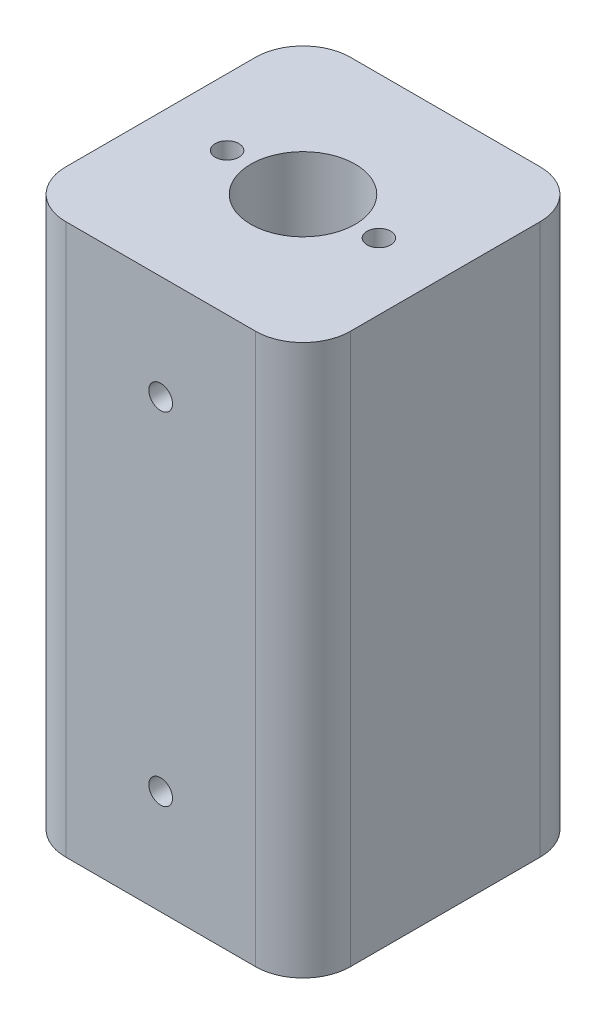
ISO-10303-21;
HEADER;
FILE_DESCRIPTION(('STEP AP214'),'2;1');
FILE_NAME('part.step','',(''),(''),'','','');
FILE_SCHEMA(('AUTOMOTIVE_DESIGN { 1 0 10303 214 1 1 1 1 }'));
ENDSEC;
DATA;
#1=APPLICATION_CONTEXT('core data for automotive mechanical design processes');
#2=APPLICATION_PROTOCOL_DEFINITION('international standard','automotive_design',2000,#1);
#3=PRODUCT_CONTEXT('',#1,'mechanical');
#4=PRODUCT('Part','Part','',(#3));
#5=PRODUCT_RELATED_PRODUCT_CATEGORY('part','',(#4));
#6=PRODUCT_DEFINITION_FORMATION('','',#4);
#7=PRODUCT_DEFINITION_CONTEXT('part definition',#1,'design');
#8=PRODUCT_DEFINITION('design','',#6,#7);
#9=PRODUCT_DEFINITION_SHAPE('','',#8);
#10=(LENGTH_UNIT() NAMED_UNIT(*) SI_UNIT(.MILLI.,.METRE.));
#11=(NAMED_UNIT(*) PLANE_ANGLE_UNIT() SI_UNIT($,.RADIAN.));
#12=(NAMED_UNIT(*) SI_UNIT($,.STERADIAN.) SOLID_ANGLE_UNIT());
#13=UNCERTAINTY_MEASURE_WITH_UNIT(LENGTH_MEASURE(1.E-05),#10,'distance_accuracy_value','');
#14=(GEOMETRIC_REPRESENTATION_CONTEXT(3) GLOBAL_UNCERTAINTY_ASSIGNED_CONTEXT((#13)) GLOBAL_UNIT_ASSIGNED_CONTEXT((#10,
#11,#12)) REPRESENTATION_CONTEXT('',''));
#15=CARTESIAN_POINT('',(0.,0.,0.));
#16=DIRECTION('',(0.,0.,1.));
#17=DIRECTION('',(1.,0.,0.));
#18=AXIS2_PLACEMENT_3D('',#15,#16,#17);
#19=CARTESIAN_POINT('',(15.,58.,-15.));
#20=DIRECTION('',(-1.,0.,0.));
#21=DIRECTION('',(0.,0.,1.));
#22=AXIS2_PLACEMENT_3D('',#19,#20,#21);
#23=PLANE('',#22);
#24=DIRECTION('',(0.,0.,-1.));
#25=VECTOR('',#24,1.);
#26=CARTESIAN_POINT('',(15.,0.,-15.));
#27=LINE('',#26,#25);
#28=CARTESIAN_POINT('',(15.,0.,10.));
#29=VERTEX_POINT('',#28);
#30=CARTESIAN_POINT('',(15.,0.,-10.));
#31=VERTEX_POINT('',#30);
#32=EDGE_CURVE('E126',#29,#31,#27,.T.);
#33=ORIENTED_EDGE('',*,*,#32,.T.);
#34=DIRECTION('',(0.,-1.,0.));
#35=VECTOR('',#34,1.);
#36=CARTESIAN_POINT('',(15.,58.,-10.));
#37=LINE('',#36,#35);
#38=CARTESIAN_POINT('',(15.,58.,-10.));
#39=VERTEX_POINT('',#38);
#40=EDGE_CURVE('E104',#31,#39,#37,.F.);
#41=ORIENTED_EDGE('',*,*,#40,.T.);
#42=DIRECTION('',(0.,0.,-1.));
#43=VECTOR('',#42,1.);
#44=CARTESIAN_POINT('',(15.,58.,-15.));
#45=LINE('',#44,#43);
#46=CARTESIAN_POINT('',(15.,58.,10.));
#47=VERTEX_POINT('',#46);
#48=EDGE_CURVE('E136',#47,#39,#45,.T.);
#49=ORIENTED_EDGE('',*,*,#48,.F.);
#50=DIRECTION('',(0.,-1.,0.));
#51=VECTOR('',#50,1.);
#52=CARTESIAN_POINT('',(15.,58.,10.));
#53=LINE('',#52,#51);
#54=EDGE_CURVE('E109',#47,#29,#53,.T.);
#55=ORIENTED_EDGE('',*,*,#54,.T.);
#56=EDGE_LOOP('',(#33,#41,#49,#55));
#57=FACE_BOUND('',#56,.T.);
#58=ADVANCED_FACE('F33',(#57),#23,.F.);
#59=CARTESIAN_POINT('',(-15.,58.,-15.));
#60=DIRECTION('',(0.,0.,1.));
#61=DIRECTION('',(1.,0.,0.));
#62=AXIS2_PLACEMENT_3D('',#59,#60,#61);
#63=PLANE('',#62);
#64=CARTESIAN_POINT('',(0.,47.,-15.));
#65=DIRECTION('',(0.,0.,1.));
#66=DIRECTION('',(1.,0.,0.));
#67=AXIS2_PLACEMENT_3D('',#64,#65,#66);
#68=CIRCLE('',#67,1.25);
#69=CARTESIAN_POINT('',(1.25,47.,-15.));
#70=VERTEX_POINT('',#69);
#71=EDGE_CURVE('E212',#70,#70,#68,.T.);
#72=ORIENTED_EDGE('',*,*,#71,.T.);
#73=EDGE_LOOP('',(#72));
#74=FACE_BOUND('',#73,.T.);
#75=CARTESIAN_POINT('',(0.,11.,-15.));
#76=DIRECTION('',(0.,0.,1.));
#77=DIRECTION('',(1.,0.,0.));
#78=AXIS2_PLACEMENT_3D('',#75,#76,#77);
#79=CIRCLE('',#78,1.25);
#80=CARTESIAN_POINT('',(1.25,11.,-15.));
#81=VERTEX_POINT('',#80);
#82=EDGE_CURVE('E206',#81,#81,#79,.T.);
#83=ORIENTED_EDGE('',*,*,#82,.T.);
#84=EDGE_LOOP('',(#83));
#85=FACE_BOUND('',#84,.T.);
#86=DIRECTION('',(-1.,0.,0.));
#87=VECTOR('',#86,1.);
#88=CARTESIAN_POINT('',(-15.,58.,-15.));
#89=LINE('',#88,#87);
#90=CARTESIAN_POINT('',(10.,58.,-15.));
#91=VERTEX_POINT('',#90);
#92=CARTESIAN_POINT('',(-10.,58.,-15.));
#93=VERTEX_POINT('',#92);
#94=EDGE_CURVE('E119',#91,#93,#89,.T.);
#95=ORIENTED_EDGE('',*,*,#94,.F.);
#96=DIRECTION('',(0.,-1.,0.));
#97=VECTOR('',#96,1.);
#98=CARTESIAN_POINT('',(10.,58.,-15.));
#99=LINE('',#98,#97);
#100=CARTESIAN_POINT('',(10.,0.,-15.));
#101=VERTEX_POINT('',#100);
#102=EDGE_CURVE('E103',#91,#101,#99,.T.);
#103=ORIENTED_EDGE('',*,*,#102,.T.);
#104=DIRECTION('',(-1.,0.,0.));
#105=VECTOR('',#104,1.);
#106=CARTESIAN_POINT('',(-15.,0.,-15.));
#107=LINE('',#106,#105);
#108=CARTESIAN_POINT('',(-10.,0.,-15.));
#109=VERTEX_POINT('',#108);
#110=EDGE_CURVE('E116',#101,#109,#107,.T.);
#111=ORIENTED_EDGE('',*,*,#110,.T.);
#112=DIRECTION('',(0.,-1.,0.));
#113=VECTOR('',#112,1.);
#114=CARTESIAN_POINT('',(-10.,58.,-15.));
#115=LINE('',#114,#113);
#116=EDGE_CURVE('E121',#109,#93,#115,.F.);
#117=ORIENTED_EDGE('',*,*,#116,.T.);
#118=EDGE_LOOP('',(#95,#103,#111,#117));
#119=FACE_BOUND('',#118,.T.);
#120=ADVANCED_FACE('F115',(#74,#85,#119),#63,.F.);
#121=CARTESIAN_POINT('',(-15.,58.,-15.));
#122=DIRECTION('',(1.,0.,0.));
#123=DIRECTION('',(0.,0.,-1.));
#124=AXIS2_PLACEMENT_3D('',#121,#122,#123);
#125=PLANE('',#124);
#126=DIRECTION('',(0.,0.,1.));
#127=VECTOR('',#126,1.);
#128=CARTESIAN_POINT('',(-15.,0.,-15.));
#129=LINE('',#128,#127);
#130=CARTESIAN_POINT('',(-15.,0.,-10.));
#131=VERTEX_POINT('',#130);
#132=CARTESIAN_POINT('',(-15.,0.,10.));
#133=VERTEX_POINT('',#132);
#134=EDGE_CURVE('E125',#131,#133,#129,.T.);
#135=ORIENTED_EDGE('',*,*,#134,.T.);
#136=DIRECTION('',(0.,-1.,0.));
#137=VECTOR('',#136,1.);
#138=CARTESIAN_POINT('',(-15.,58.,10.));
#139=LINE('',#138,#137);
#140=CARTESIAN_POINT('',(-15.,58.,10.));
#141=VERTEX_POINT('',#140);
#142=EDGE_CURVE('E11',#133,#141,#139,.F.);
#143=ORIENTED_EDGE('',*,*,#142,.T.);
#144=DIRECTION('',(0.,0.,1.));
#145=VECTOR('',#144,1.);
#146=CARTESIAN_POINT('',(-15.,58.,-15.));
#147=LINE('',#146,#145);
#148=CARTESIAN_POINT('',(-15.,58.,-10.));
#149=VERTEX_POINT('',#148);
#150=EDGE_CURVE('E162',#149,#141,#147,.T.);
#151=ORIENTED_EDGE('',*,*,#150,.F.);
#152=DIRECTION('',(0.,-1.,0.));
#153=VECTOR('',#152,1.);
#154=CARTESIAN_POINT('',(-15.,58.,-10.));
#155=LINE('',#154,#153);
#156=EDGE_CURVE('E41',#149,#131,#155,.T.);
#157=ORIENTED_EDGE('',*,*,#156,.T.);
#158=EDGE_LOOP('',(#135,#143,#151,#157));
#159=FACE_BOUND('',#158,.T.);
#160=ADVANCED_FACE('F160',(#159),#125,.F.);
#161=CARTESIAN_POINT('',(-15.,58.,15.));
#162=DIRECTION('',(0.,0.,-1.));
#163=DIRECTION('',(-1.,0.,0.));
#164=AXIS2_PLACEMENT_3D('',#161,#162,#163);
#165=PLANE('',#164);
#166=CARTESIAN_POINT('',(0.,47.,15.));
#167=DIRECTION('',(0.,0.,1.));
#168=DIRECTION('',(1.,0.,0.));
#169=AXIS2_PLACEMENT_3D('',#166,#167,#168);
#170=CIRCLE('',#169,1.25);
#171=CARTESIAN_POINT('',(1.25,47.,15.));
#172=VERTEX_POINT('',#171);
#173=EDGE_CURVE('E201',#172,#172,#170,.T.);
#174=ORIENTED_EDGE('',*,*,#173,.F.);
#175=EDGE_LOOP('',(#174));
#176=FACE_BOUND('',#175,.T.);
#177=CARTESIAN_POINT('',(0.,11.,15.));
#178=DIRECTION('',(0.,0.,1.));
#179=DIRECTION('',(1.,0.,0.));
#180=AXIS2_PLACEMENT_3D('',#177,#178,#179);
#181=CIRCLE('',#180,1.25);
#182=CARTESIAN_POINT('',(1.25,11.,15.));
#183=VERTEX_POINT('',#182);
#184=EDGE_CURVE('E194',#183,#183,#181,.T.);
#185=ORIENTED_EDGE('',*,*,#184,.F.);
#186=EDGE_LOOP('',(#185));
#187=FACE_BOUND('',#186,.T.);
#188=DIRECTION('',(1.,0.,0.));
#189=VECTOR('',#188,1.);
#190=CARTESIAN_POINT('',(-15.,0.,15.));
#191=LINE('',#190,#189);
#192=CARTESIAN_POINT('',(-10.,0.,15.));
#193=VERTEX_POINT('',#192);
#194=CARTESIAN_POINT('',(10.,0.,15.));
#195=VERTEX_POINT('',#194);
#196=EDGE_CURVE('E129',#193,#195,#191,.T.);
#197=ORIENTED_EDGE('',*,*,#196,.T.);
#198=DIRECTION('',(0.,-1.,0.));
#199=VECTOR('',#198,1.);
#200=CARTESIAN_POINT('',(10.,58.,15.));
#201=LINE('',#200,#199);
#202=CARTESIAN_POINT('',(10.,58.,15.));
#203=VERTEX_POINT('',#202);
#204=EDGE_CURVE('E48',#195,#203,#201,.F.);
#205=ORIENTED_EDGE('',*,*,#204,.T.);
#206=DIRECTION('',(1.,0.,0.));
#207=VECTOR('',#206,1.);
#208=CARTESIAN_POINT('',(-15.,58.,15.));
#209=LINE('',#208,#207);
#210=CARTESIAN_POINT('',(-10.,58.,15.));
#211=VERTEX_POINT('',#210);
#212=EDGE_CURVE('E137',#211,#203,#209,.T.);
#213=ORIENTED_EDGE('',*,*,#212,.F.);
#214=DIRECTION('',(0.,-1.,0.));
#215=VECTOR('',#214,1.);
#216=CARTESIAN_POINT('',(-10.,58.,15.));
#217=LINE('',#216,#215);
#218=EDGE_CURVE('E153',#211,#193,#217,.T.);
#219=ORIENTED_EDGE('',*,*,#218,.T.);
#220=EDGE_LOOP('',(#197,#205,#213,#219));
#221=FACE_BOUND('',#220,.T.);
#222=ADVANCED_FACE('F169',(#176,#187,#221),#165,.F.);
#223=CARTESIAN_POINT('',(0.,58.,0.));
#224=DIRECTION('',(0.,1.,0.));
#225=DIRECTION('',(0.,0.,1.));
#226=AXIS2_PLACEMENT_3D('',#223,#224,#225);
#227=PLANE('',#226);
#228=CARTESIAN_POINT('',(-8.,58.,0.));
#229=DIRECTION('',(0.,1.,0.));
#230=DIRECTION('',(0.,0.,1.));
#231=AXIS2_PLACEMENT_3D('',#228,#229,#230);
#232=CIRCLE('',#231,1.25);
#233=CARTESIAN_POINT('',(-8.,58.,1.25));
#234=VERTEX_POINT('',#233);
#235=EDGE_CURVE('E179',#234,#234,#232,.T.);
#236=ORIENTED_EDGE('',*,*,#235,.F.);
#237=EDGE_LOOP('',(#236));
#238=FACE_BOUND('',#237,.T.);
#239=CARTESIAN_POINT('',(8.,58.,0.));
#240=DIRECTION('',(0.,1.,0.));
#241=DIRECTION('',(0.,0.,1.));
#242=AXIS2_PLACEMENT_3D('',#239,#240,#241);
#243=CIRCLE('',#242,1.25);
#244=CARTESIAN_POINT('',(8.,58.,1.25));
#245=VERTEX_POINT('',#244);
#246=EDGE_CURVE('E186',#245,#245,#243,.T.);
#247=ORIENTED_EDGE('',*,*,#246,.F.);
#248=EDGE_LOOP('',(#247));
#249=FACE_BOUND('',#248,.T.);
#250=CARTESIAN_POINT('',(0.,58.,0.));
#251=DIRECTION('',(0.,1.,0.));
#252=DIRECTION('',(0.,0.,1.));
#253=AXIS2_PLACEMENT_3D('',#250,#251,#252);
#254=CIRCLE('',#253,5.5);
#255=CARTESIAN_POINT('',(0.,58.,5.5));
#256=VERTEX_POINT('',#255);
#257=EDGE_CURVE('E131',#256,#256,#254,.T.);
#258=ORIENTED_EDGE('',*,*,#257,.F.);
#259=EDGE_LOOP('',(#258));
#260=FACE_BOUND('',#259,.T.);
#261=ORIENTED_EDGE('',*,*,#48,.T.);
#262=CARTESIAN_POINT('',(10.,58.,-10.));
#263=DIRECTION('',(0.,1.,0.));
#264=DIRECTION('',(0.,0.,1.));
#265=AXIS2_PLACEMENT_3D('',#262,#263,#264);
#266=CIRCLE('',#265,5.);
#267=EDGE_CURVE('E151',#39,#91,#266,.T.);
#268=ORIENTED_EDGE('',*,*,#267,.T.);
#269=ORIENTED_EDGE('',*,*,#94,.T.);
#270=CARTESIAN_POINT('',(-10.,58.,-10.));
#271=DIRECTION('',(0.,1.,0.));
#272=DIRECTION('',(0.,0.,1.));
#273=AXIS2_PLACEMENT_3D('',#270,#271,#272);
#274=CIRCLE('',#273,5.);
#275=EDGE_CURVE('E146',#93,#149,#274,.T.);
#276=ORIENTED_EDGE('',*,*,#275,.T.);
#277=ORIENTED_EDGE('',*,*,#150,.T.);
#278=CARTESIAN_POINT('',(-10.,58.,10.));
#279=DIRECTION('',(0.,1.,0.));
#280=DIRECTION('',(0.,0.,1.));
#281=AXIS2_PLACEMENT_3D('',#278,#279,#280);
#282=CIRCLE('',#281,5.);
#283=EDGE_CURVE('E55',#141,#211,#282,.T.);
#284=ORIENTED_EDGE('',*,*,#283,.T.);
#285=ORIENTED_EDGE('',*,*,#212,.T.);
#286=CARTESIAN_POINT('',(10.,58.,10.));
#287=DIRECTION('',(0.,1.,0.));
#288=DIRECTION('',(0.,0.,1.));
#289=AXIS2_PLACEMENT_3D('',#286,#287,#288);
#290=CIRCLE('',#289,5.);
#291=EDGE_CURVE('E149',#203,#47,#290,.T.);
#292=ORIENTED_EDGE('',*,*,#291,.T.);
#293=EDGE_LOOP('',(#261,#268,#269,#276,#277,#284,#285,#292));
#294=FACE_BOUND('',#293,.T.);
#295=ADVANCED_FACE('F250',(#238,#249,#260,#294),#227,.T.);
#296=CARTESIAN_POINT('',(0.,0.,0.));
#297=DIRECTION('',(0.,1.,0.));
#298=DIRECTION('',(0.,0.,1.));
#299=AXIS2_PLACEMENT_3D('',#296,#297,#298);
#300=PLANE('',#299);
#301=CARTESIAN_POINT('',(0.,0.,0.));
#302=DIRECTION('',(0.,1.,0.));
#303=DIRECTION('',(0.,0.,1.));
#304=AXIS2_PLACEMENT_3D('',#301,#302,#303);
#305=CIRCLE('',#304,5.5);
#306=CARTESIAN_POINT('',(0.,0.,5.5));
#307=VERTEX_POINT('',#306);
#308=EDGE_CURVE('E183',#307,#307,#305,.T.);
#309=ORIENTED_EDGE('',*,*,#308,.T.);
#310=EDGE_LOOP('',(#309));
#311=FACE_BOUND('',#310,.T.);
#312=ORIENTED_EDGE('',*,*,#110,.F.);
#313=CARTESIAN_POINT('',(10.,0.,-10.));
#314=DIRECTION('',(0.,1.,0.));
#315=DIRECTION('',(0.,0.,1.));
#316=AXIS2_PLACEMENT_3D('',#313,#314,#315);
#317=CIRCLE('',#316,5.);
#318=EDGE_CURVE('E99',#101,#31,#317,.F.);
#319=ORIENTED_EDGE('',*,*,#318,.T.);
#320=ORIENTED_EDGE('',*,*,#32,.F.);
#321=CARTESIAN_POINT('',(10.,0.,10.));
#322=DIRECTION('',(0.,1.,0.));
#323=DIRECTION('',(0.,0.,1.));
#324=AXIS2_PLACEMENT_3D('',#321,#322,#323);
#325=CIRCLE('',#324,5.);
#326=EDGE_CURVE('E110',#29,#195,#325,.F.);
#327=ORIENTED_EDGE('',*,*,#326,.T.);
#328=ORIENTED_EDGE('',*,*,#196,.F.);
#329=CARTESIAN_POINT('',(-10.,0.,10.));
#330=DIRECTION('',(0.,1.,0.));
#331=DIRECTION('',(0.,0.,1.));
#332=AXIS2_PLACEMENT_3D('',#329,#330,#331);
#333=CIRCLE('',#332,5.);
#334=EDGE_CURVE('E140',#193,#133,#333,.F.);
#335=ORIENTED_EDGE('',*,*,#334,.T.);
#336=ORIENTED_EDGE('',*,*,#134,.F.);
#337=CARTESIAN_POINT('',(-10.,0.,-10.));
#338=DIRECTION('',(0.,1.,0.));
#339=DIRECTION('',(0.,0.,1.));
#340=AXIS2_PLACEMENT_3D('',#337,#338,#339);
#341=CIRCLE('',#340,5.);
#342=EDGE_CURVE('E120',#131,#109,#341,.F.);
#343=ORIENTED_EDGE('',*,*,#342,.T.);
#344=EDGE_LOOP('',(#312,#319,#320,#327,#328,#335,#336,#343));
#345=FACE_BOUND('',#344,.T.);
#346=ADVANCED_FACE('F123',(#311,#345),#300,.F.);
#347=CARTESIAN_POINT('',(0.,48.,0.));
#348=DIRECTION('',(0.,1.,0.));
#349=DIRECTION('',(0.,0.,1.));
#350=AXIS2_PLACEMENT_3D('',#347,#348,#349);
#351=CYLINDRICAL_SURFACE('',#350,5.5);
#352=ORIENTED_EDGE('',*,*,#257,.T.);
#353=EDGE_LOOP('',(#352));
#354=FACE_BOUND('',#353,.T.);
#355=ORIENTED_EDGE('',*,*,#308,.F.);
#356=EDGE_LOOP('',(#355));
#357=FACE_BOUND('',#356,.T.);
#358=ADVANCED_FACE('F260',(#354,#357),#351,.F.);
#359=CARTESIAN_POINT('',(8.,48.,0.));
#360=DIRECTION('',(0.,1.,0.));
#361=DIRECTION('',(0.,0.,1.));
#362=AXIS2_PLACEMENT_3D('',#359,#360,#361);
#363=CYLINDRICAL_SURFACE('',#362,1.25);
#364=CARTESIAN_POINT('',(8.,48.,0.));
#365=DIRECTION('',(0.,1.,0.));
#366=DIRECTION('',(0.,0.,1.));
#367=AXIS2_PLACEMENT_3D('',#364,#365,#366);
#368=CIRCLE('',#367,1.25);
#369=CARTESIAN_POINT('',(8.,48.,1.25));
#370=VERTEX_POINT('',#369);
#371=EDGE_CURVE('E178',#370,#370,#368,.T.);
#372=ORIENTED_EDGE('',*,*,#371,.F.);
#373=EDGE_LOOP('',(#372));
#374=FACE_BOUND('',#373,.T.);
#375=ORIENTED_EDGE('',*,*,#246,.T.);
#376=EDGE_LOOP('',(#375));
#377=FACE_BOUND('',#376,.T.);
#378=ADVANCED_FACE('F298',(#374,#377),#363,.F.);
#379=CARTESIAN_POINT('',(8.,48.,0.));
#380=DIRECTION('',(0.,1.,0.));
#381=DIRECTION('',(0.,0.,1.));
#382=AXIS2_PLACEMENT_3D('',#379,#380,#381);
#383=PLANE('',#382);
#384=ORIENTED_EDGE('',*,*,#371,.T.);
#385=EDGE_LOOP('',(#384));
#386=FACE_BOUND('',#385,.T.);
#387=ADVANCED_FACE('F307',(#386),#383,.T.);
#388=CARTESIAN_POINT('',(-8.,48.,0.));
#389=DIRECTION('',(0.,1.,0.));
#390=DIRECTION('',(0.,0.,1.));
#391=AXIS2_PLACEMENT_3D('',#388,#389,#390);
#392=CYLINDRICAL_SURFACE('',#391,1.25);
#393=CARTESIAN_POINT('',(-8.,48.,0.));
#394=DIRECTION('',(0.,1.,0.));
#395=DIRECTION('',(0.,0.,1.));
#396=AXIS2_PLACEMENT_3D('',#393,#394,#395);
#397=CIRCLE('',#396,1.25);
#398=CARTESIAN_POINT('',(-8.,48.,1.25));
#399=VERTEX_POINT('',#398);
#400=EDGE_CURVE('E182',#399,#399,#397,.T.);
#401=ORIENTED_EDGE('',*,*,#400,.F.);
#402=EDGE_LOOP('',(#401));
#403=FACE_BOUND('',#402,.T.);
#404=ORIENTED_EDGE('',*,*,#235,.T.);
#405=EDGE_LOOP('',(#404));
#406=FACE_BOUND('',#405,.T.);
#407=ADVANCED_FACE('F315',(#403,#406),#392,.F.);
#408=CARTESIAN_POINT('',(-8.,48.,0.));
#409=DIRECTION('',(0.,1.,0.));
#410=DIRECTION('',(0.,0.,1.));
#411=AXIS2_PLACEMENT_3D('',#408,#409,#410);
#412=PLANE('',#411);
#413=ORIENTED_EDGE('',*,*,#400,.T.);
#414=EDGE_LOOP('',(#413));
#415=FACE_BOUND('',#414,.T.);
#416=ADVANCED_FACE('F323',(#415),#412,.T.);
#417=CARTESIAN_POINT('',(0.,11.,7.));
#418=DIRECTION('',(0.,0.,1.));
#419=DIRECTION('',(1.,0.,0.));
#420=AXIS2_PLACEMENT_3D('',#417,#418,#419);
#421=CYLINDRICAL_SURFACE('',#420,1.25);
#422=CARTESIAN_POINT('',(0.,11.,7.));
#423=DIRECTION('',(0.,0.,1.));
#424=DIRECTION('',(1.,0.,0.));
#425=AXIS2_PLACEMENT_3D('',#422,#423,#424);
#426=CIRCLE('',#425,1.25);
#427=CARTESIAN_POINT('',(1.25,11.,7.));
#428=VERTEX_POINT('',#427);
#429=EDGE_CURVE('E197',#428,#428,#426,.T.);
#430=ORIENTED_EDGE('',*,*,#429,.F.);
#431=EDGE_LOOP('',(#430));
#432=FACE_BOUND('',#431,.T.);
#433=ORIENTED_EDGE('',*,*,#184,.T.);
#434=EDGE_LOOP('',(#433));
#435=FACE_BOUND('',#434,.T.);
#436=ADVANCED_FACE('F329',(#432,#435),#421,.F.);
#437=CARTESIAN_POINT('',(0.,11.,7.));
#438=DIRECTION('',(0.,0.,1.));
#439=DIRECTION('',(1.,0.,0.));
#440=AXIS2_PLACEMENT_3D('',#437,#438,#439);
#441=PLANE('',#440);
#442=ORIENTED_EDGE('',*,*,#429,.T.);
#443=EDGE_LOOP('',(#442));
#444=FACE_BOUND('',#443,.T.);
#445=ADVANCED_FACE('F336',(#444),#441,.T.);
#446=CARTESIAN_POINT('',(0.,47.,7.));
#447=DIRECTION('',(0.,0.,1.));
#448=DIRECTION('',(1.,0.,0.));
#449=AXIS2_PLACEMENT_3D('',#446,#447,#448);
#450=CYLINDRICAL_SURFACE('',#449,1.25);
#451=CARTESIAN_POINT('',(0.,47.,7.));
#452=DIRECTION('',(0.,0.,1.));
#453=DIRECTION('',(1.,0.,0.));
#454=AXIS2_PLACEMENT_3D('',#451,#452,#453);
#455=CIRCLE('',#454,1.25);
#456=CARTESIAN_POINT('',(1.25,47.,7.));
#457=VERTEX_POINT('',#456);
#458=EDGE_CURVE('E193',#457,#457,#455,.T.);
#459=ORIENTED_EDGE('',*,*,#458,.F.);
#460=EDGE_LOOP('',(#459));
#461=FACE_BOUND('',#460,.T.);
#462=ORIENTED_EDGE('',*,*,#173,.T.);
#463=EDGE_LOOP('',(#462));
#464=FACE_BOUND('',#463,.T.);
#465=ADVANCED_FACE('F344',(#461,#464),#450,.F.);
#466=CARTESIAN_POINT('',(0.,47.,7.));
#467=DIRECTION('',(0.,0.,1.));
#468=DIRECTION('',(1.,0.,0.));
#469=AXIS2_PLACEMENT_3D('',#466,#467,#468);
#470=PLANE('',#469);
#471=ORIENTED_EDGE('',*,*,#458,.T.);
#472=EDGE_LOOP('',(#471));
#473=FACE_BOUND('',#472,.T.);
#474=ADVANCED_FACE('F352',(#473),#470,.T.);
#475=CARTESIAN_POINT('',(0.,11.,-7.));
#476=DIRECTION('',(0.,0.,-1.));
#477=DIRECTION('',(-1.,0.,0.));
#478=AXIS2_PLACEMENT_3D('',#475,#476,#477);
#479=CYLINDRICAL_SURFACE('',#478,1.25);
#480=CARTESIAN_POINT('',(0.,11.,-7.));
#481=DIRECTION('',(0.,0.,1.));
#482=DIRECTION('',(1.,0.,0.));
#483=AXIS2_PLACEMENT_3D('',#480,#481,#482);
#484=CIRCLE('',#483,1.25);
#485=CARTESIAN_POINT('',(1.25,11.,-7.));
#486=VERTEX_POINT('',#485);
#487=EDGE_CURVE('E209',#486,#486,#484,.T.);
#488=ORIENTED_EDGE('',*,*,#487,.T.);
#489=EDGE_LOOP('',(#488));
#490=FACE_BOUND('',#489,.T.);
#491=ORIENTED_EDGE('',*,*,#82,.F.);
#492=EDGE_LOOP('',(#491));
#493=FACE_BOUND('',#492,.T.);
#494=ADVANCED_FACE('F360',(#490,#493),#479,.F.);
#495=CARTESIAN_POINT('',(0.,11.,-7.));
#496=DIRECTION('',(0.,0.,-1.));
#497=DIRECTION('',(1.,0.,0.));
#498=AXIS2_PLACEMENT_3D('',#495,#496,#497);
#499=PLANE('',#498);
#500=ORIENTED_EDGE('',*,*,#487,.F.);
#501=EDGE_LOOP('',(#500));
#502=FACE_BOUND('',#501,.T.);
#503=ADVANCED_FACE('F230',(#502),#499,.T.);
#504=CARTESIAN_POINT('',(0.,47.,-7.));
#505=DIRECTION('',(0.,0.,-1.));
#506=DIRECTION('',(-1.,0.,0.));
#507=AXIS2_PLACEMENT_3D('',#504,#505,#506);
#508=CYLINDRICAL_SURFACE('',#507,1.25);
#509=CARTESIAN_POINT('',(0.,47.,-7.));
#510=DIRECTION('',(0.,0.,1.));
#511=DIRECTION('',(1.,0.,0.));
#512=AXIS2_PLACEMENT_3D('',#509,#510,#511);
#513=CIRCLE('',#512,1.25);
#514=CARTESIAN_POINT('',(1.25,47.,-7.));
#515=VERTEX_POINT('',#514);
#516=EDGE_CURVE('E198',#515,#515,#513,.T.);
#517=ORIENTED_EDGE('',*,*,#516,.T.);
#518=EDGE_LOOP('',(#517));
#519=FACE_BOUND('',#518,.T.);
#520=ORIENTED_EDGE('',*,*,#71,.F.);
#521=EDGE_LOOP('',(#520));
#522=FACE_BOUND('',#521,.T.);
#523=ADVANCED_FACE('F218',(#519,#522),#508,.F.);
#524=CARTESIAN_POINT('',(0.,47.,-7.));
#525=DIRECTION('',(0.,0.,-1.));
#526=DIRECTION('',(1.,0.,0.));
#527=AXIS2_PLACEMENT_3D('',#524,#525,#526);
#528=PLANE('',#527);
#529=ORIENTED_EDGE('',*,*,#516,.F.);
#530=EDGE_LOOP('',(#529));
#531=FACE_BOUND('',#530,.T.);
#532=ADVANCED_FACE('F221',(#531),#528,.T.);
#533=CARTESIAN_POINT('',(10.,58.,-10.));
#534=DIRECTION('',(0.,-1.,0.));
#535=DIRECTION('',(0.,0.,-1.));
#536=AXIS2_PLACEMENT_3D('',#533,#534,#535);
#537=CYLINDRICAL_SURFACE('',#536,5.);
#538=ORIENTED_EDGE('',*,*,#267,.F.);
#539=ORIENTED_EDGE('',*,*,#40,.F.);
#540=ORIENTED_EDGE('',*,*,#318,.F.);
#541=ORIENTED_EDGE('',*,*,#102,.F.);
#542=EDGE_LOOP('',(#538,#539,#540,#541));
#543=FACE_BOUND('',#542,.T.);
#544=ADVANCED_FACE('F102',(#543),#537,.T.);
#545=CARTESIAN_POINT('',(10.,58.,10.));
#546=DIRECTION('',(0.,-1.,0.));
#547=DIRECTION('',(0.,0.,-1.));
#548=AXIS2_PLACEMENT_3D('',#545,#546,#547);
#549=CYLINDRICAL_SURFACE('',#548,5.);
#550=ORIENTED_EDGE('',*,*,#291,.F.);
#551=ORIENTED_EDGE('',*,*,#204,.F.);
#552=ORIENTED_EDGE('',*,*,#326,.F.);
#553=ORIENTED_EDGE('',*,*,#54,.F.);
#554=EDGE_LOOP('',(#550,#551,#552,#553));
#555=FACE_BOUND('',#554,.T.);
#556=ADVANCED_FACE('F228',(#555),#549,.T.);
#557=CARTESIAN_POINT('',(-10.,58.,10.));
#558=DIRECTION('',(0.,-1.,0.));
#559=DIRECTION('',(0.,0.,-1.));
#560=AXIS2_PLACEMENT_3D('',#557,#558,#559);
#561=CYLINDRICAL_SURFACE('',#560,5.);
#562=ORIENTED_EDGE('',*,*,#283,.F.);
#563=ORIENTED_EDGE('',*,*,#142,.F.);
#564=ORIENTED_EDGE('',*,*,#334,.F.);
#565=ORIENTED_EDGE('',*,*,#218,.F.);
#566=EDGE_LOOP('',(#562,#563,#564,#565));
#567=FACE_BOUND('',#566,.T.);
#568=ADVANCED_FACE('F168',(#567),#561,.T.);
#569=CARTESIAN_POINT('',(-10.,58.,-10.));
#570=DIRECTION('',(0.,-1.,0.));
#571=DIRECTION('',(0.,0.,-1.));
#572=AXIS2_PLACEMENT_3D('',#569,#570,#571);
#573=CYLINDRICAL_SURFACE('',#572,5.);
#574=ORIENTED_EDGE('',*,*,#275,.F.);
#575=ORIENTED_EDGE('',*,*,#116,.F.);
#576=ORIENTED_EDGE('',*,*,#342,.F.);
#577=ORIENTED_EDGE('',*,*,#156,.F.);
#578=EDGE_LOOP('',(#574,#575,#576,#577));
#579=FACE_BOUND('',#578,.T.);
#580=ADVANCED_FACE('F35',(#579),#573,.T.);
#581=CLOSED_SHELL('',(#58,#120,#160,#222,#295,#346,#358,#378,#387,#407,#416,#436,#445,#465,#474,
#494,#503,#523,#532,#544,#556,#568,#580));
#582=MANIFOLD_SOLID_BREP('B2',#581);
#583=ADVANCED_BREP_SHAPE_REPRESENTATION('',(#18,#582),#14);
#584=SHAPE_DEFINITION_REPRESENTATION(#9,#583);
ENDSEC;
END-ISO-10303-21;
